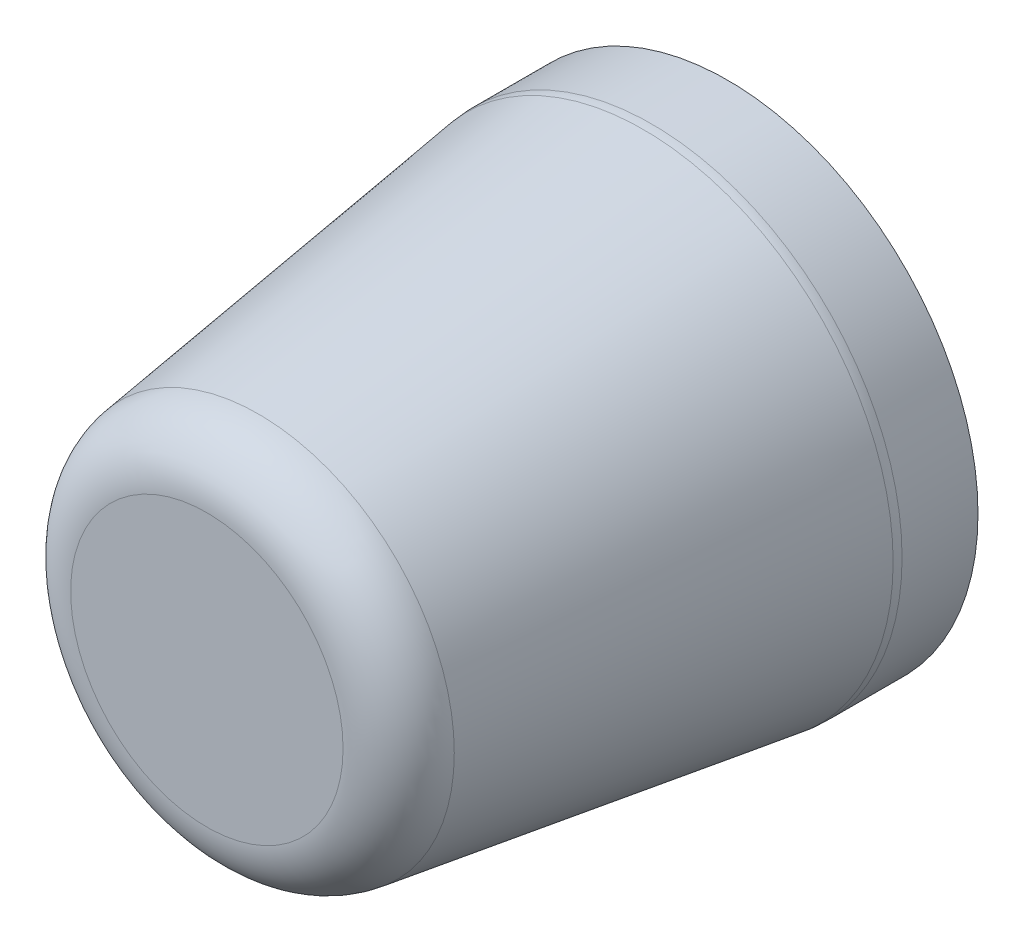
ISO-10303-21;
HEADER;
FILE_DESCRIPTION(('STEP AP214'),'2;1');
FILE_NAME('part.step','',(''),(''),'','','');
FILE_SCHEMA(('AUTOMOTIVE_DESIGN { 1 0 10303 214 1 1 1 1 }'));
ENDSEC;
DATA;
#1=APPLICATION_CONTEXT('core data for automotive mechanical design processes');
#2=APPLICATION_PROTOCOL_DEFINITION('international standard','automotive_design',2000,#1);
#3=PRODUCT_CONTEXT('',#1,'mechanical');
#4=PRODUCT('Part','Part','',(#3));
#5=PRODUCT_RELATED_PRODUCT_CATEGORY('part','',(#4));
#6=PRODUCT_DEFINITION_FORMATION('','',#4);
#7=PRODUCT_DEFINITION_CONTEXT('part definition',#1,'design');
#8=PRODUCT_DEFINITION('design','',#6,#7);
#9=PRODUCT_DEFINITION_SHAPE('','',#8);
#10=(LENGTH_UNIT() NAMED_UNIT(*) SI_UNIT(.MILLI.,.METRE.));
#11=(NAMED_UNIT(*) PLANE_ANGLE_UNIT() SI_UNIT($,.RADIAN.));
#12=(NAMED_UNIT(*) SI_UNIT($,.STERADIAN.) SOLID_ANGLE_UNIT());
#13=UNCERTAINTY_MEASURE_WITH_UNIT(LENGTH_MEASURE(1.E-05),#10,'distance_accuracy_value','');
#14=(GEOMETRIC_REPRESENTATION_CONTEXT(3) GLOBAL_UNCERTAINTY_ASSIGNED_CONTEXT((#13)) GLOBAL_UNIT_ASSIGNED_CONTEXT((#10,
#11,#12)) REPRESENTATION_CONTEXT('',''));
#15=CARTESIAN_POINT('',(0.,0.,0.));
#16=DIRECTION('',(0.,0.,1.));
#17=DIRECTION('',(1.,0.,0.));
#18=AXIS2_PLACEMENT_3D('',#15,#16,#17);
#19=CARTESIAN_POINT('',(0.,9.40810163654738,26.));
#20=DIRECTION('',(0.,0.,1.));
#21=DIRECTION('',(1.,0.,0.));
#22=AXIS2_PLACEMENT_3D('',#19,#20,#21);
#23=PLANE('',#22);
#24=CARTESIAN_POINT('',(0.,0.,26.));
#25=DIRECTION('',(0.,0.,1.));
#26=DIRECTION('',(1.,0.,0.));
#27=AXIS2_PLACEMENT_3D('',#24,#25,#26);
#28=CIRCLE('',#27,6.8002414230987);
#29=CARTESIAN_POINT('',(6.8002414230987,0.,26.));
#30=VERTEX_POINT('',#29);
#31=EDGE_CURVE('E41',#30,#30,#28,.T.);
#32=ORIENTED_EDGE('',*,*,#31,.T.);
#33=EDGE_LOOP('',(#32));
#34=FACE_BOUND('',#33,.T.);
#35=ADVANCED_FACE('F34',(#34),#23,.T.);
#36=CARTESIAN_POINT('',(0.,0.,15.));
#37=DIRECTION('',(0.,0.,-1.));
#38=DIRECTION('',(-1.,0.,0.));
#39=AXIS2_PLACEMENT_3D('',#36,#37,#38);
#40=PLANE('',#39);
#41=CARTESIAN_POINT('',(0.,0.,15.));
#42=DIRECTION('',(0.,0.,-1.));
#43=DIRECTION('',(-1.,0.,0.));
#44=AXIS2_PLACEMENT_3D('',#41,#42,#43);
#45=CIRCLE('',#44,2.);
#46=CARTESIAN_POINT('',(-2.,0.,15.));
#47=VERTEX_POINT('',#46);
#48=EDGE_CURVE('E54',#47,#47,#45,.T.);
#49=ORIENTED_EDGE('',*,*,#48,.T.);
#50=EDGE_LOOP('',(#49));
#51=FACE_BOUND('',#50,.T.);
#52=ADVANCED_FACE('F81',(#51),#40,.T.);
#53=CARTESIAN_POINT('',(0.,0.,0.));
#54=DIRECTION('',(0.,0.,-1.));
#55=DIRECTION('',(-1.,0.,0.));
#56=AXIS2_PLACEMENT_3D('',#53,#54,#55);
#57=CYLINDRICAL_SURFACE('',#56,2.);
#58=CARTESIAN_POINT('',(0.,0.,0.));
#59=DIRECTION('',(0.,0.,-1.));
#60=DIRECTION('',(-1.,0.,0.));
#61=AXIS2_PLACEMENT_3D('',#58,#59,#60);
#62=CIRCLE('',#61,2.);
#63=CARTESIAN_POINT('',(-2.,0.,0.));
#64=VERTEX_POINT('',#63);
#65=EDGE_CURVE('E57',#64,#64,#62,.T.);
#66=ORIENTED_EDGE('',*,*,#65,.T.);
#67=EDGE_LOOP('',(#66));
#68=FACE_BOUND('',#67,.T.);
#69=ORIENTED_EDGE('',*,*,#48,.F.);
#70=EDGE_LOOP('',(#69));
#71=FACE_BOUND('',#70,.T.);
#72=ADVANCED_FACE('F78',(#68,#71),#57,.F.);
#73=CARTESIAN_POINT('',(0.,2.,0.));
#74=DIRECTION('',(0.,0.,-1.));
#75=DIRECTION('',(-1.,0.,0.));
#76=AXIS2_PLACEMENT_3D('',#73,#74,#75);
#77=PLANE('',#76);
#78=CARTESIAN_POINT('',(0.,0.,0.));
#79=DIRECTION('',(0.,0.,-1.));
#80=DIRECTION('',(-1.,0.,0.));
#81=AXIS2_PLACEMENT_3D('',#78,#79,#80);
#82=CIRCLE('',#81,12.5);
#83=CARTESIAN_POINT('',(-12.5,0.,0.));
#84=VERTEX_POINT('',#83);
#85=EDGE_CURVE('E60',#84,#84,#82,.T.);
#86=ORIENTED_EDGE('',*,*,#85,.T.);
#87=EDGE_LOOP('',(#86));
#88=FACE_BOUND('',#87,.T.);
#89=ORIENTED_EDGE('',*,*,#65,.F.);
#90=EDGE_LOOP('',(#89));
#91=FACE_BOUND('',#90,.T.);
#92=ADVANCED_FACE('F64',(#88,#91),#77,.T.);
#93=CARTESIAN_POINT('',(0.,0.,0.));
#94=DIRECTION('',(0.,0.,-1.));
#95=DIRECTION('',(-1.,0.,0.));
#96=AXIS2_PLACEMENT_3D('',#93,#94,#95);
#97=CYLINDRICAL_SURFACE('',#96,12.5);
#98=CARTESIAN_POINT('',(0.,0.,3.79021956416947));
#99=DIRECTION('',(0.,0.,1.));
#100=DIRECTION('',(1.,0.,0.));
#101=AXIS2_PLACEMENT_3D('',#98,#99,#100);
#102=CIRCLE('',#101,12.5);
#103=CARTESIAN_POINT('',(12.5,0.,3.79021956416947));
#104=VERTEX_POINT('',#103);
#105=EDGE_CURVE('E10',#104,#104,#102,.F.);
#106=ORIENTED_EDGE('',*,*,#105,.T.);
#107=EDGE_LOOP('',(#106));
#108=FACE_BOUND('',#107,.T.);
#109=ORIENTED_EDGE('',*,*,#85,.F.);
#110=EDGE_LOOP('',(#109));
#111=FACE_BOUND('',#110,.T.);
#112=ADVANCED_FACE('F67',(#108,#111),#97,.T.);
#113=CARTESIAN_POINT('',(0.,0.,4.));
#114=DIRECTION('',(0.,0.,-1.));
#115=DIRECTION('',(-1.,0.,0.));
#116=AXIS2_PLACEMENT_3D('',#113,#114,#115);
#117=CONICAL_SURFACE('',#116,12.5,0.139626340159547);
#118=CARTESIAN_POINT('',(0.,0.,23.4175193028802));
#119=DIRECTION('',(0.,0.,1.));
#120=DIRECTION('',(1.,0.,0.));
#121=AXIS2_PLACEMENT_3D('',#118,#119,#120);
#122=CIRCLE('',#121,9.77104562932341);
#123=CARTESIAN_POINT('',(9.77104562932341,0.,23.4175193028802));
#124=VERTEX_POINT('',#123);
#125=EDGE_CURVE('E45',#124,#124,#122,.F.);
#126=ORIENTED_EDGE('',*,*,#125,.T.);
#127=EDGE_LOOP('',(#126));
#128=FACE_BOUND('',#127,.T.);
#129=CARTESIAN_POINT('',(0.,0.,4.20773886704966));
#130=DIRECTION('',(0.,0.,1.));
#131=DIRECTION('',(1.,0.,0.));
#132=AXIS2_PLACEMENT_3D('',#129,#130,#131);
#133=CIRCLE('',#132,12.4708042062247);
#134=CARTESIAN_POINT('',(12.4708042062247,0.,4.20773886704966));
#135=VERTEX_POINT('',#134);
#136=EDGE_CURVE('E49',#135,#135,#133,.T.);
#137=ORIENTED_EDGE('',*,*,#136,.T.);
#138=EDGE_LOOP('',(#137));
#139=FACE_BOUND('',#138,.T.);
#140=ADVANCED_FACE('F69',(#128,#139),#117,.T.);
#141=CARTESIAN_POINT('',(0.,0.,23.));
#142=DIRECTION('',(0.,0.,1.));
#143=DIRECTION('',(1.,0.,0.));
#144=AXIS2_PLACEMENT_3D('',#141,#142,#143);
#145=TOROIDAL_SURFACE('',#144,6.8002414230987,3.);
#146=ORIENTED_EDGE('',*,*,#31,.F.);
#147=EDGE_LOOP('',(#146));
#148=FACE_BOUND('',#147,.T.);
#149=ORIENTED_EDGE('',*,*,#125,.F.);
#150=EDGE_LOOP('',(#149));
#151=FACE_BOUND('',#150,.T.);
#152=ADVANCED_FACE('F75',(#148,#151),#145,.T.);
#153=CARTESIAN_POINT('',(0.,0.,3.79021956416947));
#154=DIRECTION('',(0.,0.,1.));
#155=DIRECTION('',(1.,0.,0.));
#156=AXIS2_PLACEMENT_3D('',#153,#154,#155);
#157=TOROIDAL_SURFACE('',#156,9.5,3.);
#158=ORIENTED_EDGE('',*,*,#136,.F.);
#159=EDGE_LOOP('',(#158));
#160=FACE_BOUND('',#159,.T.);
#161=ORIENTED_EDGE('',*,*,#105,.F.);
#162=EDGE_LOOP('',(#161));
#163=FACE_BOUND('',#162,.T.);
#164=ADVANCED_FACE('F36',(#160,#163),#157,.T.);
#165=CLOSED_SHELL('',(#35,#52,#72,#92,#112,#140,#152,#164));
#166=MANIFOLD_SOLID_BREP('B2',#165);
#167=ADVANCED_BREP_SHAPE_REPRESENTATION('',(#18,#166),#14);
#168=SHAPE_DEFINITION_REPRESENTATION(#9,#167);
ENDSEC;
END-ISO-10303-21;
